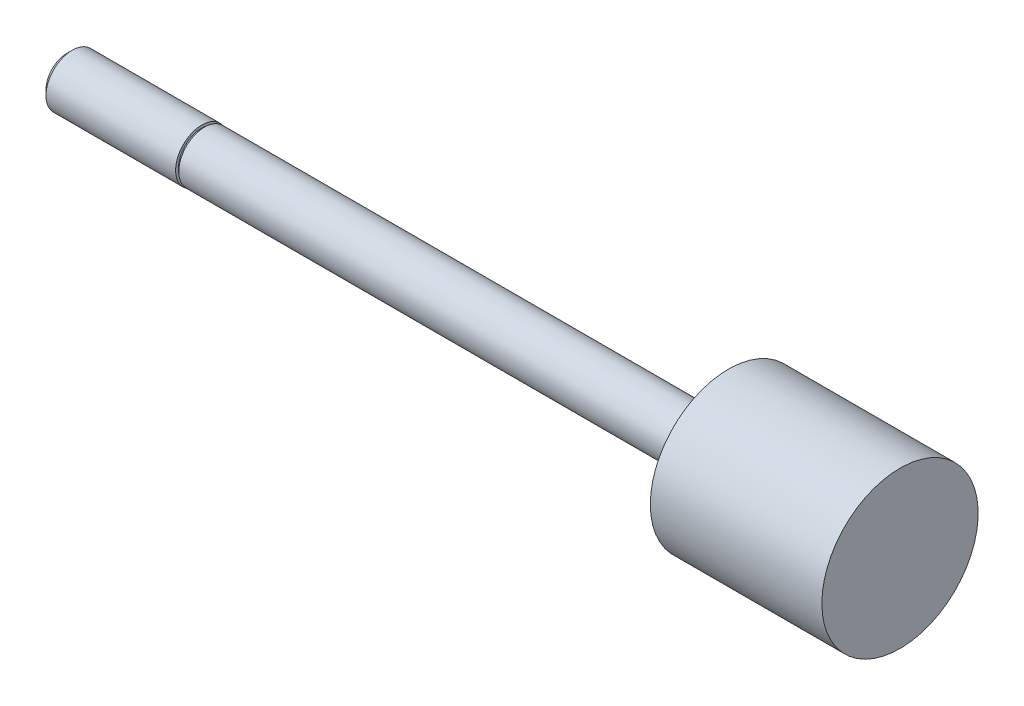
ISO-10303-21;
HEADER;
FILE_DESCRIPTION(('STEP AP214'),'2;1');
FILE_NAME('part.step','',(''),(''),'','','');
FILE_SCHEMA(('AUTOMOTIVE_DESIGN { 1 0 10303 214 1 1 1 1 }'));
ENDSEC;
DATA;
#1=APPLICATION_CONTEXT('core data for automotive mechanical design processes');
#2=APPLICATION_PROTOCOL_DEFINITION('international standard','automotive_design',2000,#1);
#3=PRODUCT_CONTEXT('',#1,'mechanical');
#4=PRODUCT('Part','Part','',(#3));
#5=PRODUCT_RELATED_PRODUCT_CATEGORY('part','',(#4));
#6=PRODUCT_DEFINITION_FORMATION('','',#4);
#7=PRODUCT_DEFINITION_CONTEXT('part definition',#1,'design');
#8=PRODUCT_DEFINITION('design','',#6,#7);
#9=PRODUCT_DEFINITION_SHAPE('','',#8);
#10=(LENGTH_UNIT() NAMED_UNIT(*) SI_UNIT(.MILLI.,.METRE.));
#11=(NAMED_UNIT(*) PLANE_ANGLE_UNIT() SI_UNIT($,.RADIAN.));
#12=(NAMED_UNIT(*) SI_UNIT($,.STERADIAN.) SOLID_ANGLE_UNIT());
#13=UNCERTAINTY_MEASURE_WITH_UNIT(LENGTH_MEASURE(1.E-05),#10,'distance_accuracy_value','');
#14=(GEOMETRIC_REPRESENTATION_CONTEXT(3) GLOBAL_UNCERTAINTY_ASSIGNED_CONTEXT((#13)) GLOBAL_UNIT_ASSIGNED_CONTEXT((#10,
#11,#12)) REPRESENTATION_CONTEXT('',''));
#15=CARTESIAN_POINT('',(0.,0.,0.));
#16=DIRECTION('',(0.,0.,1.));
#17=DIRECTION('',(1.,0.,0.));
#18=AXIS2_PLACEMENT_3D('',#15,#16,#17);
#19=CARTESIAN_POINT('',(64.262,0.,0.));
#20=DIRECTION('',(-1.,0.,0.));
#21=DIRECTION('',(0.,0.,1.));
#22=AXIS2_PLACEMENT_3D('',#19,#20,#21);
#23=CYLINDRICAL_SURFACE('',#22,2.3749);
#24=CARTESIAN_POINT('',(0.,0.,0.));
#25=DIRECTION('',(-1.,0.,0.));
#26=DIRECTION('',(0.,0.,1.));
#27=AXIS2_PLACEMENT_3D('',#24,#25,#26);
#28=CIRCLE('',#27,2.3749);
#29=CARTESIAN_POINT('',(0.,0.,2.3749));
#30=VERTEX_POINT('',#29);
#31=EDGE_CURVE('E56',#30,#30,#28,.T.);
#32=ORIENTED_EDGE('',*,*,#31,.F.);
#33=EDGE_LOOP('',(#32));
#34=FACE_BOUND('',#33,.T.);
#35=CARTESIAN_POINT('',(48.4124,0.,0.));
#36=DIRECTION('',(-1.,0.,0.));
#37=DIRECTION('',(0.,0.,1.));
#38=AXIS2_PLACEMENT_3D('',#35,#36,#37);
#39=CIRCLE('',#38,2.3749);
#40=CARTESIAN_POINT('',(48.4124,0.,2.3749));
#41=VERTEX_POINT('',#40);
#42=EDGE_CURVE('E10',#41,#41,#39,.T.);
#43=ORIENTED_EDGE('',*,*,#42,.T.);
#44=EDGE_LOOP('',(#43));
#45=FACE_BOUND('',#44,.T.);
#46=ADVANCED_FACE('F34',(#34,#45),#23,.T.);
#47=CARTESIAN_POINT('',(48.4124,2.3749,0.));
#48=DIRECTION('',(1.,0.,0.));
#49=DIRECTION('',(0.,0.,-1.));
#50=AXIS2_PLACEMENT_3D('',#47,#48,#49);
#51=PLANE('',#50);
#52=ORIENTED_EDGE('',*,*,#42,.F.);
#53=EDGE_LOOP('',(#52));
#54=FACE_BOUND('',#53,.T.);
#55=CARTESIAN_POINT('',(48.4124,0.,0.));
#56=DIRECTION('',(-1.,0.,0.));
#57=DIRECTION('',(0.,0.,1.));
#58=AXIS2_PLACEMENT_3D('',#55,#56,#57);
#59=CIRCLE('',#58,7.21995);
#60=CARTESIAN_POINT('',(48.4124,0.,7.21995));
#61=VERTEX_POINT('',#60);
#62=EDGE_CURVE('E41',#61,#61,#59,.T.);
#63=ORIENTED_EDGE('',*,*,#62,.T.);
#64=EDGE_LOOP('',(#63));
#65=FACE_BOUND('',#64,.T.);
#66=ADVANCED_FACE('F77',(#54,#65),#51,.F.);
#67=CARTESIAN_POINT('',(64.262,0.,0.));
#68=DIRECTION('',(-1.,0.,0.));
#69=DIRECTION('',(0.,0.,1.));
#70=AXIS2_PLACEMENT_3D('',#67,#68,#69);
#71=CYLINDRICAL_SURFACE('',#70,7.21995);
#72=ORIENTED_EDGE('',*,*,#62,.F.);
#73=EDGE_LOOP('',(#72));
#74=FACE_BOUND('',#73,.T.);
#75=CARTESIAN_POINT('',(64.262,0.,0.));
#76=DIRECTION('',(-1.,0.,0.));
#77=DIRECTION('',(0.,0.,1.));
#78=AXIS2_PLACEMENT_3D('',#75,#76,#77);
#79=CIRCLE('',#78,7.21995);
#80=CARTESIAN_POINT('',(64.262,0.,7.21995));
#81=VERTEX_POINT('',#80);
#82=EDGE_CURVE('E45',#81,#81,#79,.T.);
#83=ORIENTED_EDGE('',*,*,#82,.T.);
#84=EDGE_LOOP('',(#83));
#85=FACE_BOUND('',#84,.T.);
#86=ADVANCED_FACE('F81',(#74,#85),#71,.T.);
#87=CARTESIAN_POINT('',(64.262,7.21995,0.));
#88=DIRECTION('',(-1.,0.,0.));
#89=DIRECTION('',(0.,0.,1.));
#90=AXIS2_PLACEMENT_3D('',#87,#88,#89);
#91=PLANE('',#90);
#92=ORIENTED_EDGE('',*,*,#82,.F.);
#93=EDGE_LOOP('',(#92));
#94=FACE_BOUND('',#93,.T.);
#95=ADVANCED_FACE('F86',(#94),#91,.F.);
#96=CARTESIAN_POINT('',(-0.254,2.667,0.));
#97=DIRECTION('',(1.,0.,0.));
#98=DIRECTION('',(0.,0.,-1.));
#99=AXIS2_PLACEMENT_3D('',#96,#97,#98);
#100=PLANE('',#99);
#101=CARTESIAN_POINT('',(-0.254,0.,0.));
#102=DIRECTION('',(-1.,0.,0.));
#103=DIRECTION('',(0.,0.,1.));
#104=AXIS2_PLACEMENT_3D('',#101,#102,#103);
#105=CIRCLE('',#104,2.159);
#106=CARTESIAN_POINT('',(-0.254,0.,2.159));
#107=VERTEX_POINT('',#106);
#108=EDGE_CURVE('E59',#107,#107,#105,.T.);
#109=ORIENTED_EDGE('',*,*,#108,.T.);
#110=EDGE_LOOP('',(#109));
#111=FACE_BOUND('',#110,.T.);
#112=CARTESIAN_POINT('',(-0.254,0.,0.));
#113=DIRECTION('',(1.,0.,0.));
#114=DIRECTION('',(0.,0.,-1.));
#115=AXIS2_PLACEMENT_3D('',#112,#113,#114);
#116=CIRCLE('',#115,2.413);
#117=CARTESIAN_POINT('',(-0.254,0.,-2.413));
#118=VERTEX_POINT('',#117);
#119=EDGE_CURVE('E37',#118,#118,#116,.T.);
#120=ORIENTED_EDGE('',*,*,#119,.T.);
#121=EDGE_LOOP('',(#120));
#122=FACE_BOUND('',#121,.T.);
#123=ADVANCED_FACE('F72',(#111,#122),#100,.T.);
#124=CARTESIAN_POINT('',(0.,2.159,0.));
#125=DIRECTION('',(-1.,0.,0.));
#126=DIRECTION('',(0.,0.,1.));
#127=AXIS2_PLACEMENT_3D('',#124,#125,#126);
#128=PLANE('',#127);
#129=CARTESIAN_POINT('',(0.,0.,0.));
#130=DIRECTION('',(-1.,0.,0.));
#131=DIRECTION('',(0.,0.,1.));
#132=AXIS2_PLACEMENT_3D('',#129,#130,#131);
#133=CIRCLE('',#132,2.159);
#134=CARTESIAN_POINT('',(0.,0.,2.159));
#135=VERTEX_POINT('',#134);
#136=EDGE_CURVE('E62',#135,#135,#133,.T.);
#137=ORIENTED_EDGE('',*,*,#136,.F.);
#138=EDGE_LOOP('',(#137));
#139=FACE_BOUND('',#138,.T.);
#140=ORIENTED_EDGE('',*,*,#31,.T.);
#141=EDGE_LOOP('',(#140));
#142=FACE_BOUND('',#141,.T.);
#143=ADVANCED_FACE('F69',(#139,#142),#128,.T.);
#144=CARTESIAN_POINT('',(0.,0.,0.));
#145=DIRECTION('',(-1.,0.,0.));
#146=DIRECTION('',(0.,0.,1.));
#147=AXIS2_PLACEMENT_3D('',#144,#145,#146);
#148=CYLINDRICAL_SURFACE('',#147,2.159);
#149=ORIENTED_EDGE('',*,*,#136,.T.);
#150=EDGE_LOOP('',(#149));
#151=FACE_BOUND('',#150,.T.);
#152=ORIENTED_EDGE('',*,*,#108,.F.);
#153=EDGE_LOOP('',(#152));
#154=FACE_BOUND('',#153,.T.);
#155=ADVANCED_FACE('F66',(#151,#154),#148,.T.);
#156=CARTESIAN_POINT('',(-12.7,0.,0.));
#157=DIRECTION('',(1.,0.,0.));
#158=DIRECTION('',(0.,0.,-1.));
#159=AXIS2_PLACEMENT_3D('',#156,#157,#158);
#160=PLANE('',#159);
#161=CARTESIAN_POINT('',(-12.7,0.,0.));
#162=DIRECTION('',(-1.,0.,0.));
#163=DIRECTION('',(0.,0.,1.));
#164=AXIS2_PLACEMENT_3D('',#161,#162,#163);
#165=CIRCLE('',#164,1.94056);
#166=CARTESIAN_POINT('',(-12.7,0.,1.94056));
#167=VERTEX_POINT('',#166);
#168=EDGE_CURVE('E50',#167,#167,#165,.T.);
#169=ORIENTED_EDGE('',*,*,#168,.T.);
#170=EDGE_LOOP('',(#169));
#171=FACE_BOUND('',#170,.T.);
#172=ADVANCED_FACE('F94',(#171),#160,.F.);
#173=CARTESIAN_POINT('',(-12.22756,0.,0.));
#174=DIRECTION('',(1.,0.,0.));
#175=DIRECTION('',(0.,0.,-1.));
#176=AXIS2_PLACEMENT_3D('',#173,#174,#175);
#177=CONICAL_SURFACE('',#176,2.413,0.785398163397449);
#178=ORIENTED_EDGE('',*,*,#168,.F.);
#179=EDGE_LOOP('',(#178));
#180=FACE_BOUND('',#179,.T.);
#181=CARTESIAN_POINT('',(-12.22756,0.,0.));
#182=DIRECTION('',(-1.,0.,0.));
#183=DIRECTION('',(0.,0.,1.));
#184=AXIS2_PLACEMENT_3D('',#181,#182,#183);
#185=CIRCLE('',#184,2.413);
#186=CARTESIAN_POINT('',(-12.22756,0.,2.413));
#187=VERTEX_POINT('',#186);
#188=EDGE_CURVE('E53',#187,#187,#185,.T.);
#189=ORIENTED_EDGE('',*,*,#188,.T.);
#190=EDGE_LOOP('',(#189));
#191=FACE_BOUND('',#190,.T.);
#192=ADVANCED_FACE('F97',(#180,#191),#177,.T.);
#193=CARTESIAN_POINT('',(0.,0.,0.));
#194=DIRECTION('',(-1.,0.,0.));
#195=DIRECTION('',(0.,0.,1.));
#196=AXIS2_PLACEMENT_3D('',#193,#194,#195);
#197=CYLINDRICAL_SURFACE('',#196,2.413);
#198=ORIENTED_EDGE('',*,*,#188,.F.);
#199=EDGE_LOOP('',(#198));
#200=FACE_BOUND('',#199,.T.);
#201=ORIENTED_EDGE('',*,*,#119,.F.);
#202=EDGE_LOOP('',(#201));
#203=FACE_BOUND('',#202,.T.);
#204=ADVANCED_FACE('F101',(#200,#203),#197,.T.);
#205=CLOSED_SHELL('',(#46,#66,#86,#95,#123,#143,#155,#172,#192,#204));
#206=MANIFOLD_SOLID_BREP('B2',#205);
#207=ADVANCED_BREP_SHAPE_REPRESENTATION('',(#18,#206),#14);
#208=SHAPE_DEFINITION_REPRESENTATION(#9,#207);
ENDSEC;
END-ISO-10303-21;
